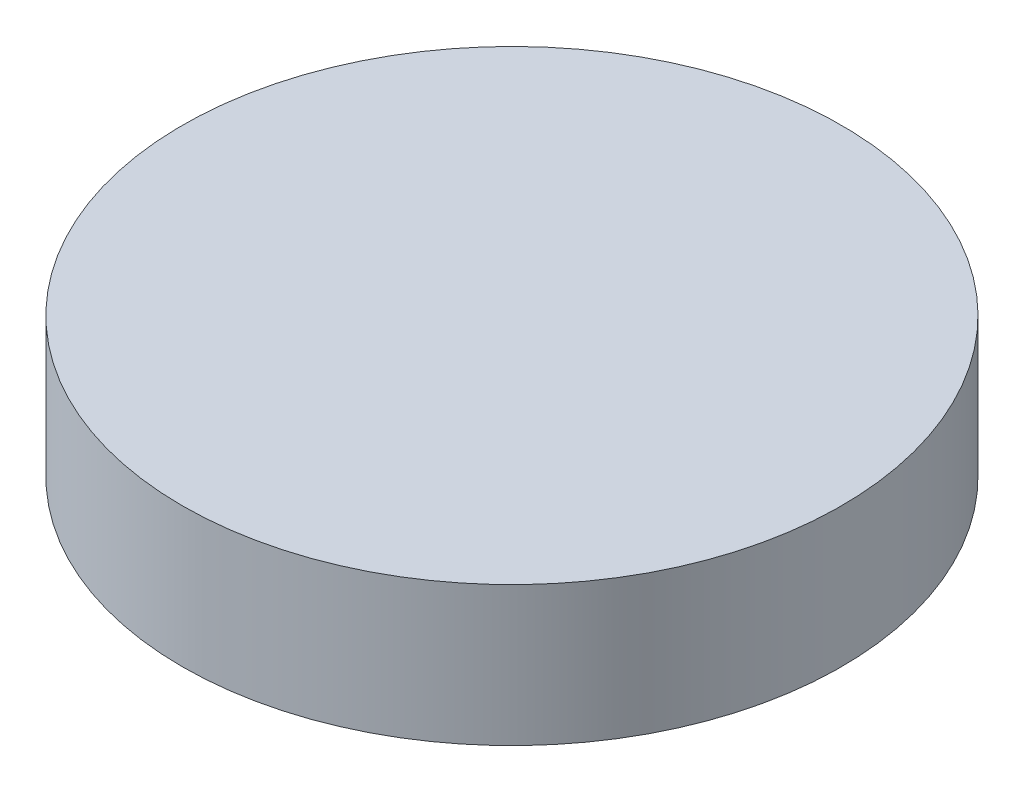
ISO-10303-21;
HEADER;
FILE_DESCRIPTION(('STEP AP214'),'2;1');
FILE_NAME('part.step','',(''),(''),'','','');
FILE_SCHEMA(('AUTOMOTIVE_DESIGN { 1 0 10303 214 1 1 1 1 }'));
ENDSEC;
DATA;
#1=APPLICATION_CONTEXT('core data for automotive mechanical design processes');
#2=APPLICATION_PROTOCOL_DEFINITION('international standard','automotive_design',2000,#1);
#3=PRODUCT_CONTEXT('',#1,'mechanical');
#4=PRODUCT('Part','Part','',(#3));
#5=PRODUCT_RELATED_PRODUCT_CATEGORY('part','',(#4));
#6=PRODUCT_DEFINITION_FORMATION('','',#4);
#7=PRODUCT_DEFINITION_CONTEXT('part definition',#1,'design');
#8=PRODUCT_DEFINITION('design','',#6,#7);
#9=PRODUCT_DEFINITION_SHAPE('','',#8);
#10=(LENGTH_UNIT() NAMED_UNIT(*) SI_UNIT(.MILLI.,.METRE.));
#11=(NAMED_UNIT(*) PLANE_ANGLE_UNIT() SI_UNIT($,.RADIAN.));
#12=(NAMED_UNIT(*) SI_UNIT($,.STERADIAN.) SOLID_ANGLE_UNIT());
#13=UNCERTAINTY_MEASURE_WITH_UNIT(LENGTH_MEASURE(1.E-05),#10,'distance_accuracy_value','');
#14=(GEOMETRIC_REPRESENTATION_CONTEXT(3) GLOBAL_UNCERTAINTY_ASSIGNED_CONTEXT((#13)) GLOBAL_UNIT_ASSIGNED_CONTEXT((#10,
#11,#12)) REPRESENTATION_CONTEXT('',''));
#15=CARTESIAN_POINT('',(0.,0.,0.));
#16=DIRECTION('',(0.,0.,1.));
#17=DIRECTION('',(1.,0.,0.));
#18=AXIS2_PLACEMENT_3D('',#15,#16,#17);
#19=CARTESIAN_POINT('',(0.,0.,0.));
#20=DIRECTION('',(0.,1.,0.));
#21=DIRECTION('',(0.,0.,1.));
#22=AXIS2_PLACEMENT_3D('',#19,#20,#21);
#23=PLANE('',#22);
#24=CARTESIAN_POINT('',(0.,0.,0.));
#25=DIRECTION('',(0.,1.,0.));
#26=DIRECTION('',(0.,0.,1.));
#27=AXIS2_PLACEMENT_3D('',#24,#25,#26);
#28=CIRCLE('',#27,39.);
#29=CARTESIAN_POINT('',(0.,0.,39.));
#30=VERTEX_POINT('',#29);
#31=EDGE_CURVE('E10',#30,#30,#28,.T.);
#32=ORIENTED_EDGE('',*,*,#31,.F.);
#33=EDGE_LOOP('',(#32));
#34=FACE_BOUND('',#33,.T.);
#35=CARTESIAN_POINT('',(0.,0.,0.));
#36=DIRECTION('',(0.,1.,0.));
#37=DIRECTION('',(0.,0.,1.));
#38=AXIS2_PLACEMENT_3D('',#35,#36,#37);
#39=CIRCLE('',#38,36.);
#40=CARTESIAN_POINT('',(0.,0.,36.));
#41=VERTEX_POINT('',#40);
#42=EDGE_CURVE('E45',#41,#41,#39,.T.);
#43=ORIENTED_EDGE('',*,*,#42,.T.);
#44=EDGE_LOOP('',(#43));
#45=FACE_BOUND('',#44,.T.);
#46=ADVANCED_FACE('F37',(#34,#45),#23,.F.);
#47=CARTESIAN_POINT('',(0.,8.5,0.));
#48=DIRECTION('',(0.,-1.,0.));
#49=DIRECTION('',(0.,0.,-1.));
#50=AXIS2_PLACEMENT_3D('',#47,#48,#49);
#51=CYLINDRICAL_SURFACE('',#50,39.);
#52=ORIENTED_EDGE('',*,*,#31,.T.);
#53=EDGE_LOOP('',(#52));
#54=FACE_BOUND('',#53,.T.);
#55=CARTESIAN_POINT('',(0.,16.5,0.));
#56=DIRECTION('',(0.,1.,0.));
#57=DIRECTION('',(0.,0.,1.));
#58=AXIS2_PLACEMENT_3D('',#55,#56,#57);
#59=CIRCLE('',#58,39.);
#60=CARTESIAN_POINT('',(0.,16.5,39.));
#61=VERTEX_POINT('',#60);
#62=EDGE_CURVE('E105',#61,#61,#59,.T.);
#63=ORIENTED_EDGE('',*,*,#62,.F.);
#64=EDGE_LOOP('',(#63));
#65=FACE_BOUND('',#64,.T.);
#66=ADVANCED_FACE('F39',(#54,#65),#51,.T.);
#67=CARTESIAN_POINT('',(0.,8.5,0.));
#68=DIRECTION('',(0.,-1.,0.));
#69=DIRECTION('',(0.,0.,-1.));
#70=AXIS2_PLACEMENT_3D('',#67,#68,#69);
#71=CYLINDRICAL_SURFACE('',#70,36.);
#72=CARTESIAN_POINT('',(0.,8.5,0.));
#73=DIRECTION('',(0.,1.,0.));
#74=DIRECTION('',(0.,0.,1.));
#75=AXIS2_PLACEMENT_3D('',#72,#73,#74);
#76=CIRCLE('',#75,36.);
#77=CARTESIAN_POINT('',(0.,8.5,36.));
#78=VERTEX_POINT('',#77);
#79=EDGE_CURVE('E50',#78,#78,#76,.T.);
#80=ORIENTED_EDGE('',*,*,#79,.T.);
#81=EDGE_LOOP('',(#80));
#82=FACE_BOUND('',#81,.T.);
#83=ORIENTED_EDGE('',*,*,#42,.F.);
#84=EDGE_LOOP('',(#83));
#85=FACE_BOUND('',#84,.T.);
#86=ADVANCED_FACE('F113',(#82,#85),#71,.F.);
#87=CARTESIAN_POINT('',(0.,8.5,0.));
#88=DIRECTION('',(0.,1.,0.));
#89=DIRECTION('',(0.,0.,1.));
#90=AXIS2_PLACEMENT_3D('',#87,#88,#89);
#91=PLANE('',#90);
#92=CARTESIAN_POINT('',(-31.3848650377394,8.5,-10.1975608143724));
#93=DIRECTION('',(0.,1.,0.));
#94=DIRECTION('',(0.,0.,1.));
#95=AXIS2_PLACEMENT_3D('',#92,#93,#94);
#96=CIRCLE('',#95,1.69864588274162);
#97=CARTESIAN_POINT('',(-31.3848650377394,8.5,-8.49891493163076));
#98=VERTEX_POINT('',#97);
#99=EDGE_CURVE('E91',#98,#98,#96,.T.);
#100=ORIENTED_EDGE('',*,*,#99,.T.);
#101=EDGE_LOOP('',(#100));
#102=FACE_BOUND('',#101,.T.);
#103=CARTESIAN_POINT('',(-19.3969133256499,8.5,26.6975608143738));
#104=DIRECTION('',(0.,1.,0.));
#105=DIRECTION('',(0.,0.,1.));
#106=AXIS2_PLACEMENT_3D('',#103,#104,#105);
#107=CIRCLE('',#106,1.69864588274243);
#108=CARTESIAN_POINT('',(-19.3969133256499,8.5,28.3962066971162));
#109=VERTEX_POINT('',#108);
#110=EDGE_CURVE('E83',#109,#109,#107,.T.);
#111=ORIENTED_EDGE('',*,*,#110,.T.);
#112=EDGE_LOOP('',(#111));
#113=FACE_BOUND('',#112,.T.);
#114=CARTESIAN_POINT('',(19.3969133256533,8.5,26.6975608143727));
#115=DIRECTION('',(0.,1.,0.));
#116=DIRECTION('',(0.,0.,1.));
#117=AXIS2_PLACEMENT_3D('',#114,#115,#116);
#118=CIRCLE('',#117,1.69864588274201);
#119=CARTESIAN_POINT('',(19.3969133256533,8.5,28.3962066971147));
#120=VERTEX_POINT('',#119);
#121=EDGE_CURVE('E75',#120,#120,#118,.T.);
#122=ORIENTED_EDGE('',*,*,#121,.T.);
#123=EDGE_LOOP('',(#122));
#124=FACE_BOUND('',#123,.T.);
#125=CARTESIAN_POINT('',(31.3848650377407,8.5,-10.1975608143742));
#126=DIRECTION('',(0.,1.,0.));
#127=DIRECTION('',(0.,0.,1.));
#128=AXIS2_PLACEMENT_3D('',#125,#126,#127);
#129=CIRCLE('',#128,1.69864588274082);
#130=CARTESIAN_POINT('',(31.3848650377407,8.5,-8.49891493163333));
#131=VERTEX_POINT('',#130);
#132=EDGE_CURVE('E65',#131,#131,#129,.T.);
#133=ORIENTED_EDGE('',*,*,#132,.T.);
#134=EDGE_LOOP('',(#133));
#135=FACE_BOUND('',#134,.T.);
#136=CARTESIAN_POINT('',(0.,8.5,-33.));
#137=DIRECTION('',(0.,1.,0.));
#138=DIRECTION('',(0.,0.,1.));
#139=AXIS2_PLACEMENT_3D('',#136,#137,#138);
#140=CIRCLE('',#139,1.69864588274038);
#141=CARTESIAN_POINT('',(0.,8.5,-31.3013541172596));
#142=VERTEX_POINT('',#141);
#143=EDGE_CURVE('E61',#142,#142,#140,.T.);
#144=ORIENTED_EDGE('',*,*,#143,.T.);
#145=EDGE_LOOP('',(#144));
#146=FACE_BOUND('',#145,.T.);
#147=CARTESIAN_POINT('',(0.,8.5,0.));
#148=DIRECTION('',(0.,1.,0.));
#149=DIRECTION('',(0.,0.,1.));
#150=AXIS2_PLACEMENT_3D('',#147,#148,#149);
#151=CIRCLE('',#150,30.);
#152=CARTESIAN_POINT('',(0.,8.5,30.));
#153=VERTEX_POINT('',#152);
#154=EDGE_CURVE('E55',#153,#153,#151,.T.);
#155=ORIENTED_EDGE('',*,*,#154,.T.);
#156=EDGE_LOOP('',(#155));
#157=FACE_BOUND('',#156,.T.);
#158=ORIENTED_EDGE('',*,*,#79,.F.);
#159=EDGE_LOOP('',(#158));
#160=FACE_BOUND('',#159,.T.);
#161=ADVANCED_FACE('F118',(#102,#113,#124,#135,#146,#157,#160),#91,.F.);
#162=CARTESIAN_POINT('',(0.,11.7,0.));
#163=DIRECTION('',(0.,-1.,0.));
#164=DIRECTION('',(0.,0.,-1.));
#165=AXIS2_PLACEMENT_3D('',#162,#163,#164);
#166=CYLINDRICAL_SURFACE('',#165,30.);
#167=ORIENTED_EDGE('',*,*,#154,.F.);
#168=EDGE_LOOP('',(#167));
#169=FACE_BOUND('',#168,.T.);
#170=CARTESIAN_POINT('',(0.,14.5,0.));
#171=DIRECTION('',(0.,1.,0.));
#172=DIRECTION('',(0.,0.,1.));
#173=AXIS2_PLACEMENT_3D('',#170,#171,#172);
#174=CIRCLE('',#173,30.);
#175=CARTESIAN_POINT('',(0.,14.5,30.));
#176=VERTEX_POINT('',#175);
#177=EDGE_CURVE('E101',#176,#176,#174,.T.);
#178=ORIENTED_EDGE('',*,*,#177,.T.);
#179=EDGE_LOOP('',(#178));
#180=FACE_BOUND('',#179,.T.);
#181=ADVANCED_FACE('F127',(#169,#180),#166,.F.);
#182=CARTESIAN_POINT('',(0.,11.7,-33.));
#183=DIRECTION('',(0.,-1.,0.));
#184=DIRECTION('',(0.,0.,-1.));
#185=AXIS2_PLACEMENT_3D('',#182,#183,#184);
#186=CYLINDRICAL_SURFACE('',#185,1.69864588274038);
#187=CARTESIAN_POINT('',(0.,11.7,-33.));
#188=DIRECTION('',(0.,1.,0.));
#189=DIRECTION('',(0.,0.,1.));
#190=AXIS2_PLACEMENT_3D('',#187,#188,#189);
#191=CIRCLE('',#190,1.69864588274038);
#192=CARTESIAN_POINT('',(0.,11.7,-31.3013541172596));
#193=VERTEX_POINT('',#192);
#194=EDGE_CURVE('E66',#193,#193,#191,.T.);
#195=ORIENTED_EDGE('',*,*,#194,.T.);
#196=EDGE_LOOP('',(#195));
#197=FACE_BOUND('',#196,.T.);
#198=ORIENTED_EDGE('',*,*,#143,.F.);
#199=EDGE_LOOP('',(#198));
#200=FACE_BOUND('',#199,.T.);
#201=ADVANCED_FACE('F131',(#197,#200),#186,.F.);
#202=CARTESIAN_POINT('',(31.3848650377407,11.7,-10.1975608143742));
#203=DIRECTION('',(0.,-1.,0.));
#204=DIRECTION('',(0.,0.,-1.));
#205=AXIS2_PLACEMENT_3D('',#202,#203,#204);
#206=CYLINDRICAL_SURFACE('',#205,1.69864588274082);
#207=CARTESIAN_POINT('',(31.3848650377407,11.7,-10.1975608143742));
#208=DIRECTION('',(0.,1.,0.));
#209=DIRECTION('',(0.,0.,1.));
#210=AXIS2_PLACEMENT_3D('',#207,#208,#209);
#211=CIRCLE('',#210,1.69864588274082);
#212=CARTESIAN_POINT('',(31.3848650377407,11.7,-8.49891493163333));
#213=VERTEX_POINT('',#212);
#214=EDGE_CURVE('E70',#213,#213,#211,.T.);
#215=ORIENTED_EDGE('',*,*,#214,.T.);
#216=EDGE_LOOP('',(#215));
#217=FACE_BOUND('',#216,.T.);
#218=ORIENTED_EDGE('',*,*,#132,.F.);
#219=EDGE_LOOP('',(#218));
#220=FACE_BOUND('',#219,.T.);
#221=ADVANCED_FACE('F135',(#217,#220),#206,.F.);
#222=CARTESIAN_POINT('',(19.3969133256533,11.7,26.6975608143727));
#223=DIRECTION('',(0.,-1.,0.));
#224=DIRECTION('',(0.,0.,-1.));
#225=AXIS2_PLACEMENT_3D('',#222,#223,#224);
#226=CYLINDRICAL_SURFACE('',#225,1.69864588274201);
#227=CARTESIAN_POINT('',(19.3969133256533,11.7,26.6975608143727));
#228=DIRECTION('',(0.,1.,0.));
#229=DIRECTION('',(0.,0.,1.));
#230=AXIS2_PLACEMENT_3D('',#227,#228,#229);
#231=CIRCLE('',#230,1.69864588274201);
#232=CARTESIAN_POINT('',(19.3969133256533,11.7,28.3962066971147));
#233=VERTEX_POINT('',#232);
#234=EDGE_CURVE('E71',#233,#233,#231,.T.);
#235=ORIENTED_EDGE('',*,*,#234,.T.);
#236=EDGE_LOOP('',(#235));
#237=FACE_BOUND('',#236,.T.);
#238=ORIENTED_EDGE('',*,*,#121,.F.);
#239=EDGE_LOOP('',(#238));
#240=FACE_BOUND('',#239,.T.);
#241=ADVANCED_FACE('F139',(#237,#240),#226,.F.);
#242=CARTESIAN_POINT('',(-19.3969133256499,11.7,26.6975608143738));
#243=DIRECTION('',(0.,-1.,0.));
#244=DIRECTION('',(0.,0.,-1.));
#245=AXIS2_PLACEMENT_3D('',#242,#243,#244);
#246=CYLINDRICAL_SURFACE('',#245,1.69864588274243);
#247=CARTESIAN_POINT('',(-19.3969133256499,11.7,26.6975608143738));
#248=DIRECTION('',(0.,1.,0.));
#249=DIRECTION('',(0.,0.,1.));
#250=AXIS2_PLACEMENT_3D('',#247,#248,#249);
#251=CIRCLE('',#250,1.69864588274243);
#252=CARTESIAN_POINT('',(-19.3969133256499,11.7,28.3962066971162));
#253=VERTEX_POINT('',#252);
#254=EDGE_CURVE('E79',#253,#253,#251,.T.);
#255=ORIENTED_EDGE('',*,*,#254,.T.);
#256=EDGE_LOOP('',(#255));
#257=FACE_BOUND('',#256,.T.);
#258=ORIENTED_EDGE('',*,*,#110,.F.);
#259=EDGE_LOOP('',(#258));
#260=FACE_BOUND('',#259,.T.);
#261=ADVANCED_FACE('F143',(#257,#260),#246,.F.);
#262=CARTESIAN_POINT('',(-31.3848650377394,11.7,-10.1975608143724));
#263=DIRECTION('',(0.,-1.,0.));
#264=DIRECTION('',(0.,0.,-1.));
#265=AXIS2_PLACEMENT_3D('',#262,#263,#264);
#266=CYLINDRICAL_SURFACE('',#265,1.69864588274162);
#267=CARTESIAN_POINT('',(-31.3848650377394,11.7,-10.1975608143724));
#268=DIRECTION('',(0.,1.,0.));
#269=DIRECTION('',(0.,0.,1.));
#270=AXIS2_PLACEMENT_3D('',#267,#268,#269);
#271=CIRCLE('',#270,1.69864588274162);
#272=CARTESIAN_POINT('',(-31.3848650377394,11.7,-8.49891493163076));
#273=VERTEX_POINT('',#272);
#274=EDGE_CURVE('E87',#273,#273,#271,.T.);
#275=ORIENTED_EDGE('',*,*,#274,.T.);
#276=EDGE_LOOP('',(#275));
#277=FACE_BOUND('',#276,.T.);
#278=ORIENTED_EDGE('',*,*,#99,.F.);
#279=EDGE_LOOP('',(#278));
#280=FACE_BOUND('',#279,.T.);
#281=ADVANCED_FACE('F147',(#277,#280),#266,.F.);
#282=CARTESIAN_POINT('',(0.,11.7,0.));
#283=DIRECTION('',(0.,1.,0.));
#284=DIRECTION('',(0.,0.,1.));
#285=AXIS2_PLACEMENT_3D('',#282,#283,#284);
#286=PLANE('',#285);
#287=ORIENTED_EDGE('',*,*,#274,.F.);
#288=EDGE_LOOP('',(#287));
#289=FACE_BOUND('',#288,.T.);
#290=ADVANCED_FACE('F151',(#289),#286,.F.);
#291=ORIENTED_EDGE('',*,*,#234,.F.);
#292=EDGE_LOOP('',(#291));
#293=FACE_BOUND('',#292,.T.);
#294=ADVANCED_FACE('F186',(#293),#286,.F.);
#295=ORIENTED_EDGE('',*,*,#194,.F.);
#296=EDGE_LOOP('',(#295));
#297=FACE_BOUND('',#296,.T.);
#298=ADVANCED_FACE('F179',(#297),#286,.F.);
#299=ORIENTED_EDGE('',*,*,#214,.F.);
#300=EDGE_LOOP('',(#299));
#301=FACE_BOUND('',#300,.T.);
#302=ADVANCED_FACE('F157',(#301),#286,.F.);
#303=ORIENTED_EDGE('',*,*,#254,.F.);
#304=EDGE_LOOP('',(#303));
#305=FACE_BOUND('',#304,.T.);
#306=ADVANCED_FACE('F153',(#305),#286,.F.);
#307=CARTESIAN_POINT('',(0.,14.5,0.));
#308=DIRECTION('',(0.,1.,0.));
#309=DIRECTION('',(0.,0.,1.));
#310=AXIS2_PLACEMENT_3D('',#307,#308,#309);
#311=PLANE('',#310);
#312=ORIENTED_EDGE('',*,*,#177,.F.);
#313=EDGE_LOOP('',(#312));
#314=FACE_BOUND('',#313,.T.);
#315=ADVANCED_FACE('F156',(#314),#311,.F.);
#316=CARTESIAN_POINT('',(0.,16.5,0.));
#317=DIRECTION('',(0.,1.,0.));
#318=DIRECTION('',(0.,0.,1.));
#319=AXIS2_PLACEMENT_3D('',#316,#317,#318);
#320=PLANE('',#319);
#321=ORIENTED_EDGE('',*,*,#62,.T.);
#322=EDGE_LOOP('',(#321));
#323=FACE_BOUND('',#322,.T.);
#324=ADVANCED_FACE('F110',(#323),#320,.T.);
#325=CLOSED_SHELL('',(#46,#66,#86,#161,#181,#201,#221,#241,#261,#281,#290,#294,#298,#302,#306,
#315,#324));
#326=MANIFOLD_SOLID_BREP('B2',#325);
#327=ADVANCED_BREP_SHAPE_REPRESENTATION('',(#18,#326),#14);
#328=SHAPE_DEFINITION_REPRESENTATION(#9,#327);
ENDSEC;
END-ISO-10303-21;
